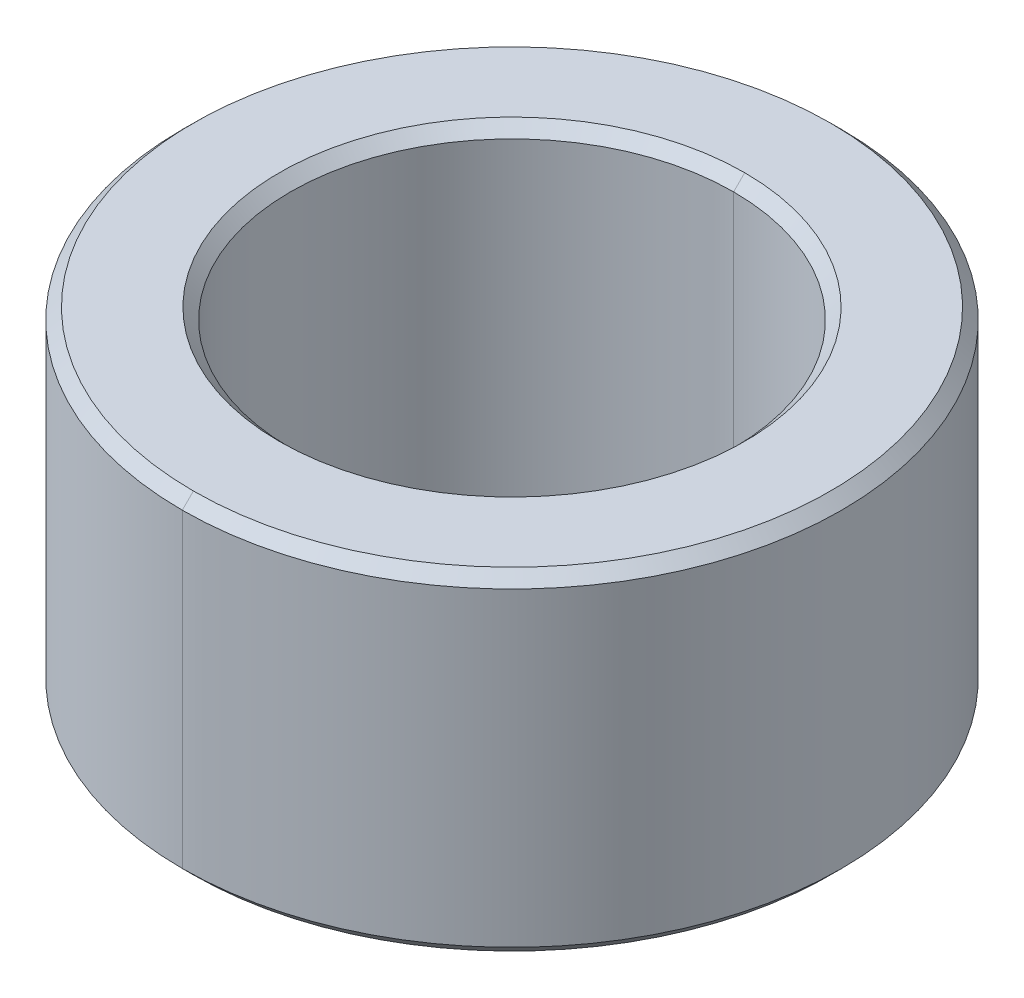
ISO-10303-21;
HEADER;
FILE_DESCRIPTION(('STEP AP214'),'2;1');
FILE_NAME('part.step','',(''),(''),'','','');
FILE_SCHEMA(('AUTOMOTIVE_DESIGN { 1 0 10303 214 1 1 1 1 }'));
ENDSEC;
DATA;
#1=APPLICATION_CONTEXT('core data for automotive mechanical design processes');
#2=APPLICATION_PROTOCOL_DEFINITION('international standard','automotive_design',2000,#1);
#3=PRODUCT_CONTEXT('',#1,'mechanical');
#4=PRODUCT('Part','Part','',(#3));
#5=PRODUCT_RELATED_PRODUCT_CATEGORY('part','',(#4));
#6=PRODUCT_DEFINITION_FORMATION('','',#4);
#7=PRODUCT_DEFINITION_CONTEXT('part definition',#1,'design');
#8=PRODUCT_DEFINITION('design','',#6,#7);
#9=PRODUCT_DEFINITION_SHAPE('','',#8);
#10=(LENGTH_UNIT() NAMED_UNIT(*) SI_UNIT(.MILLI.,.METRE.));
#11=(NAMED_UNIT(*) PLANE_ANGLE_UNIT() SI_UNIT($,.RADIAN.));
#12=(NAMED_UNIT(*) SI_UNIT($,.STERADIAN.) SOLID_ANGLE_UNIT());
#13=UNCERTAINTY_MEASURE_WITH_UNIT(LENGTH_MEASURE(1.E-05),#10,'distance_accuracy_value','');
#14=(GEOMETRIC_REPRESENTATION_CONTEXT(3) GLOBAL_UNCERTAINTY_ASSIGNED_CONTEXT((#13)) GLOBAL_UNIT_ASSIGNED_CONTEXT((#10,
#11,#12)) REPRESENTATION_CONTEXT('',''));
#15=CARTESIAN_POINT('',(0.,0.,0.));
#16=DIRECTION('',(0.,0.,1.));
#17=DIRECTION('',(1.,0.,0.));
#18=AXIS2_PLACEMENT_3D('',#15,#16,#17);
#19=CARTESIAN_POINT('',(0.,1.4,0.));
#20=DIRECTION('',(0.,1.,0.));
#21=DIRECTION('',(0.,0.,1.));
#22=AXIS2_PLACEMENT_3D('',#19,#20,#21);
#23=CONICAL_SURFACE('',#22,2.,0.78539816339745);
#24=DIRECTION('',(0.,0.707106781186546,-0.707106781186549));
#25=VECTOR('',#24,1.);
#26=CARTESIAN_POINT('',(0.,1.4,-2.));
#27=LINE('',#26,#25);
#28=CARTESIAN_POINT('',(0.,1.4,-2.));
#29=VERTEX_POINT('',#28);
#30=CARTESIAN_POINT('',(0.,1.5,-2.1));
#31=VERTEX_POINT('',#30);
#32=EDGE_CURVE('E126',#29,#31,#27,.T.);
#33=ORIENTED_EDGE('',*,*,#32,.F.);
#34=CARTESIAN_POINT('',(0.,1.4,0.));
#35=DIRECTION('',(0.,1.,0.));
#36=DIRECTION('',(0.,0.,1.));
#37=AXIS2_PLACEMENT_3D('',#34,#35,#36);
#38=CIRCLE('',#37,2.);
#39=CARTESIAN_POINT('',(0.,1.4,2.));
#40=VERTEX_POINT('',#39);
#41=EDGE_CURVE('E26',#40,#29,#38,.T.);
#42=ORIENTED_EDGE('',*,*,#41,.F.);
#43=DIRECTION('',(0.,0.707106781186546,0.707106781186549));
#44=VECTOR('',#43,1.);
#45=CARTESIAN_POINT('',(0.,1.4,2.));
#46=LINE('',#45,#44);
#47=CARTESIAN_POINT('',(0.,1.5,2.1));
#48=VERTEX_POINT('',#47);
#49=EDGE_CURVE('E118',#40,#48,#46,.T.);
#50=ORIENTED_EDGE('',*,*,#49,.T.);
#51=CARTESIAN_POINT('',(0.,1.5,0.));
#52=DIRECTION('',(0.,-1.,0.));
#53=DIRECTION('',(0.,0.,1.));
#54=AXIS2_PLACEMENT_3D('',#51,#52,#53);
#55=CIRCLE('',#54,2.1);
#56=EDGE_CURVE('E108',#31,#48,#55,.T.);
#57=ORIENTED_EDGE('',*,*,#56,.F.);
#58=EDGE_LOOP('',(#33,#42,#50,#57));
#59=FACE_BOUND('',#58,.T.);
#60=ADVANCED_FACE('F15',(#59),#23,.F.);
#61=CARTESIAN_POINT('',(0.,-1.5,0.));
#62=DIRECTION('',(0.,-1.,0.));
#63=DIRECTION('',(0.,0.,-1.));
#64=AXIS2_PLACEMENT_3D('',#61,#62,#63);
#65=CONICAL_SURFACE('',#64,2.1,0.78539816339744);
#66=DIRECTION('',(0.,-0.707106781186554,0.707106781186542));
#67=VECTOR('',#66,1.);
#68=CARTESIAN_POINT('',(0.,-1.5,2.1));
#69=LINE('',#68,#67);
#70=CARTESIAN_POINT('',(0.,-1.4,2.));
#71=VERTEX_POINT('',#70);
#72=CARTESIAN_POINT('',(0.,-1.5,2.1));
#73=VERTEX_POINT('',#72);
#74=EDGE_CURVE('E144',#71,#73,#69,.T.);
#75=ORIENTED_EDGE('',*,*,#74,.F.);
#76=CARTESIAN_POINT('',(0.,-1.4,0.));
#77=DIRECTION('',(0.,-1.,0.));
#78=DIRECTION('',(0.,0.,1.));
#79=AXIS2_PLACEMENT_3D('',#76,#77,#78);
#80=CIRCLE('',#79,2.);
#81=CARTESIAN_POINT('',(0.,-1.4,-2.));
#82=VERTEX_POINT('',#81);
#83=EDGE_CURVE('E10',#82,#71,#80,.T.);
#84=ORIENTED_EDGE('',*,*,#83,.F.);
#85=DIRECTION('',(0.,-0.707106781186554,-0.707106781186542));
#86=VECTOR('',#85,1.);
#87=CARTESIAN_POINT('',(0.,-1.5,-2.1));
#88=LINE('',#87,#86);
#89=CARTESIAN_POINT('',(0.,-1.5,-2.1));
#90=VERTEX_POINT('',#89);
#91=EDGE_CURVE('E143',#82,#90,#88,.T.);
#92=ORIENTED_EDGE('',*,*,#91,.T.);
#93=CARTESIAN_POINT('',(0.,-1.5,0.));
#94=DIRECTION('',(0.,1.,0.));
#95=DIRECTION('',(0.,0.,1.));
#96=AXIS2_PLACEMENT_3D('',#93,#94,#95);
#97=CIRCLE('',#96,2.1);
#98=EDGE_CURVE('E233',#73,#90,#97,.T.);
#99=ORIENTED_EDGE('',*,*,#98,.F.);
#100=EDGE_LOOP('',(#75,#84,#92,#99));
#101=FACE_BOUND('',#100,.T.);
#102=ADVANCED_FACE('F353',(#101),#65,.F.);
#103=CARTESIAN_POINT('',(0.,1.5,0.));
#104=DIRECTION('',(0.,-1.,0.));
#105=DIRECTION('',(0.,0.,-1.));
#106=AXIS2_PLACEMENT_3D('',#103,#104,#105);
#107=CONICAL_SURFACE('',#106,2.875,0.785398163397448);
#108=DIRECTION('',(0.,-0.707106781186548,0.707106781186548));
#109=VECTOR('',#108,1.);
#110=CARTESIAN_POINT('',(0.,1.5,2.875));
#111=LINE('',#110,#109);
#112=CARTESIAN_POINT('',(0.,1.5,2.875));
#113=VERTEX_POINT('',#112);
#114=CARTESIAN_POINT('',(0.,1.4,2.975));
#115=VERTEX_POINT('',#114);
#116=EDGE_CURVE('E19',#113,#115,#111,.T.);
#117=ORIENTED_EDGE('',*,*,#116,.F.);
#118=CARTESIAN_POINT('',(0.,1.5,0.));
#119=DIRECTION('',(0.,1.,0.));
#120=DIRECTION('',(0.,0.,1.));
#121=AXIS2_PLACEMENT_3D('',#118,#119,#120);
#122=CIRCLE('',#121,2.875);
#123=CARTESIAN_POINT('',(0.,1.5,-2.875));
#124=VERTEX_POINT('',#123);
#125=EDGE_CURVE('E115',#124,#113,#122,.T.);
#126=ORIENTED_EDGE('',*,*,#125,.F.);
#127=DIRECTION('',(0.,-0.707106781186548,-0.707106781186548));
#128=VECTOR('',#127,1.);
#129=CARTESIAN_POINT('',(0.,1.5,-2.875));
#130=LINE('',#129,#128);
#131=CARTESIAN_POINT('',(0.,1.4,-2.975));
#132=VERTEX_POINT('',#131);
#133=EDGE_CURVE('E146',#124,#132,#130,.T.);
#134=ORIENTED_EDGE('',*,*,#133,.T.);
#135=CARTESIAN_POINT('',(0.,1.4,0.));
#136=DIRECTION('',(0.,-1.,0.));
#137=DIRECTION('',(0.,0.,1.));
#138=AXIS2_PLACEMENT_3D('',#135,#136,#137);
#139=CIRCLE('',#138,2.975);
#140=EDGE_CURVE('E204',#115,#132,#139,.T.);
#141=ORIENTED_EDGE('',*,*,#140,.F.);
#142=EDGE_LOOP('',(#117,#126,#134,#141));
#143=FACE_BOUND('',#142,.T.);
#144=ADVANCED_FACE('F202',(#143),#107,.T.);
#145=CARTESIAN_POINT('',(0.,-1.4,0.));
#146=DIRECTION('',(0.,1.,0.));
#147=DIRECTION('',(0.,0.,1.));
#148=AXIS2_PLACEMENT_3D('',#145,#146,#147);
#149=CONICAL_SURFACE('',#148,2.975,0.785398163397448);
#150=DIRECTION('',(0.,0.707106781186548,-0.707106781186548));
#151=VECTOR('',#150,1.);
#152=CARTESIAN_POINT('',(0.,-1.4,-2.975));
#153=LINE('',#152,#151);
#154=CARTESIAN_POINT('',(0.,-1.5,-2.875));
#155=VERTEX_POINT('',#154);
#156=CARTESIAN_POINT('',(0.,-1.4,-2.975));
#157=VERTEX_POINT('',#156);
#158=EDGE_CURVE('E187',#155,#157,#153,.T.);
#159=ORIENTED_EDGE('',*,*,#158,.F.);
#160=CARTESIAN_POINT('',(0.,-1.5,0.));
#161=DIRECTION('',(0.,-1.,0.));
#162=DIRECTION('',(0.,0.,1.));
#163=AXIS2_PLACEMENT_3D('',#160,#161,#162);
#164=CIRCLE('',#163,2.875);
#165=CARTESIAN_POINT('',(0.,-1.5,2.875));
#166=VERTEX_POINT('',#165);
#167=EDGE_CURVE('E114',#166,#155,#164,.T.);
#168=ORIENTED_EDGE('',*,*,#167,.F.);
#169=DIRECTION('',(0.,0.707106781186548,0.707106781186548));
#170=VECTOR('',#169,1.);
#171=CARTESIAN_POINT('',(0.,-1.4,2.975));
#172=LINE('',#171,#170);
#173=CARTESIAN_POINT('',(0.,-1.4,2.975));
#174=VERTEX_POINT('',#173);
#175=EDGE_CURVE('E167',#166,#174,#172,.T.);
#176=ORIENTED_EDGE('',*,*,#175,.T.);
#177=CARTESIAN_POINT('',(0.,-1.4,0.));
#178=DIRECTION('',(0.,1.,0.));
#179=DIRECTION('',(0.,0.,1.));
#180=AXIS2_PLACEMENT_3D('',#177,#178,#179);
#181=CIRCLE('',#180,2.975);
#182=EDGE_CURVE('E41',#157,#174,#181,.T.);
#183=ORIENTED_EDGE('',*,*,#182,.F.);
#184=EDGE_LOOP('',(#159,#168,#176,#183));
#185=FACE_BOUND('',#184,.T.);
#186=ADVANCED_FACE('F242',(#185),#149,.T.);
#187=CARTESIAN_POINT('',(0.,1.5,0.));
#188=DIRECTION('',(0.,-1.,0.));
#189=DIRECTION('',(0.,0.,-1.));
#190=AXIS2_PLACEMENT_3D('',#187,#188,#189);
#191=CYLINDRICAL_SURFACE('',#190,2.);
#192=DIRECTION('',(0.,-1.,0.));
#193=VECTOR('',#192,1.);
#194=CARTESIAN_POINT('',(0.,1.5,2.));
#195=LINE('',#194,#193);
#196=EDGE_CURVE('E164',#40,#71,#195,.T.);
#197=ORIENTED_EDGE('',*,*,#196,.F.);
#198=ORIENTED_EDGE('',*,*,#41,.T.);
#199=DIRECTION('',(0.,-1.,0.));
#200=VECTOR('',#199,1.);
#201=CARTESIAN_POINT('',(0.,1.5,-2.));
#202=LINE('',#201,#200);
#203=EDGE_CURVE('E166',#29,#82,#202,.T.);
#204=ORIENTED_EDGE('',*,*,#203,.T.);
#205=ORIENTED_EDGE('',*,*,#83,.T.);
#206=EDGE_LOOP('',(#197,#198,#204,#205));
#207=FACE_BOUND('',#206,.T.);
#208=ADVANCED_FACE('F348',(#207),#191,.F.);
#209=CARTESIAN_POINT('',(0.,1.5,0.));
#210=DIRECTION('',(0.,-1.,0.));
#211=DIRECTION('',(0.,0.,-1.));
#212=AXIS2_PLACEMENT_3D('',#209,#210,#211);
#213=CYLINDRICAL_SURFACE('',#212,2.975);
#214=DIRECTION('',(0.,-1.,0.));
#215=VECTOR('',#214,1.);
#216=CARTESIAN_POINT('',(0.,1.5,2.975));
#217=LINE('',#216,#215);
#218=EDGE_CURVE('E157',#115,#174,#217,.T.);
#219=ORIENTED_EDGE('',*,*,#218,.F.);
#220=ORIENTED_EDGE('',*,*,#140,.T.);
#221=DIRECTION('',(0.,-1.,0.));
#222=VECTOR('',#221,1.);
#223=CARTESIAN_POINT('',(0.,1.5,-2.975));
#224=LINE('',#223,#222);
#225=EDGE_CURVE('E154',#132,#157,#224,.T.);
#226=ORIENTED_EDGE('',*,*,#225,.T.);
#227=ORIENTED_EDGE('',*,*,#182,.T.);
#228=EDGE_LOOP('',(#219,#220,#226,#227));
#229=FACE_BOUND('',#228,.T.);
#230=ADVANCED_FACE('F372',(#229),#213,.T.);
#231=CARTESIAN_POINT('',(0.,-1.5,0.));
#232=DIRECTION('',(0.,1.,0.));
#233=DIRECTION('',(1.,0.,0.));
#234=AXIS2_PLACEMENT_3D('',#231,#232,#233);
#235=PLANE('',#234);
#236=CARTESIAN_POINT('',(0.,-1.5,0.));
#237=DIRECTION('',(0.,1.,0.));
#238=DIRECTION('',(0.,0.,1.));
#239=AXIS2_PLACEMENT_3D('',#236,#237,#238);
#240=CIRCLE('',#239,2.1);
#241=EDGE_CURVE('E140',#90,#73,#240,.T.);
#242=ORIENTED_EDGE('',*,*,#241,.T.);
#243=ORIENTED_EDGE('',*,*,#98,.T.);
#244=EDGE_LOOP('',(#242,#243));
#245=FACE_BOUND('',#244,.T.);
#246=ORIENTED_EDGE('',*,*,#167,.T.);
#247=CARTESIAN_POINT('',(0.,-1.5,0.));
#248=DIRECTION('',(0.,-1.,0.));
#249=DIRECTION('',(0.,0.,1.));
#250=AXIS2_PLACEMENT_3D('',#247,#248,#249);
#251=CIRCLE('',#250,2.875);
#252=EDGE_CURVE('E150',#155,#166,#251,.T.);
#253=ORIENTED_EDGE('',*,*,#252,.T.);
#254=EDGE_LOOP('',(#246,#253));
#255=FACE_BOUND('',#254,.T.);
#256=ADVANCED_FACE('F239',(#245,#255),#235,.F.);
#257=CARTESIAN_POINT('',(0.,1.5,0.));
#258=DIRECTION('',(0.,1.,0.));
#259=DIRECTION('',(1.,0.,0.));
#260=AXIS2_PLACEMENT_3D('',#257,#258,#259);
#261=PLANE('',#260);
#262=CARTESIAN_POINT('',(0.,1.5,0.));
#263=DIRECTION('',(0.,-1.,0.));
#264=DIRECTION('',(0.,0.,1.));
#265=AXIS2_PLACEMENT_3D('',#262,#263,#264);
#266=CIRCLE('',#265,2.1);
#267=EDGE_CURVE('E111',#48,#31,#266,.T.);
#268=ORIENTED_EDGE('',*,*,#267,.T.);
#269=ORIENTED_EDGE('',*,*,#56,.T.);
#270=EDGE_LOOP('',(#268,#269));
#271=FACE_BOUND('',#270,.T.);
#272=ORIENTED_EDGE('',*,*,#125,.T.);
#273=CARTESIAN_POINT('',(0.,1.5,0.));
#274=DIRECTION('',(0.,1.,0.));
#275=DIRECTION('',(0.,0.,1.));
#276=AXIS2_PLACEMENT_3D('',#273,#274,#275);
#277=CIRCLE('',#276,2.875);
#278=EDGE_CURVE('E163',#113,#124,#277,.T.);
#279=ORIENTED_EDGE('',*,*,#278,.T.);
#280=EDGE_LOOP('',(#272,#279));
#281=FACE_BOUND('',#280,.T.);
#282=ADVANCED_FACE('F17',(#271,#281),#261,.T.);
#283=CARTESIAN_POINT('',(0.,1.5,0.));
#284=DIRECTION('',(0.,-1.,0.));
#285=DIRECTION('',(0.,0.,-1.));
#286=AXIS2_PLACEMENT_3D('',#283,#284,#285);
#287=CYLINDRICAL_SURFACE('',#286,2.975);
#288=CARTESIAN_POINT('',(0.,1.4,0.));
#289=DIRECTION('',(0.,-1.,0.));
#290=DIRECTION('',(0.,0.,1.));
#291=AXIS2_PLACEMENT_3D('',#288,#289,#290);
#292=CIRCLE('',#291,2.975);
#293=EDGE_CURVE('E138',#132,#115,#292,.T.);
#294=ORIENTED_EDGE('',*,*,#293,.T.);
#295=ORIENTED_EDGE('',*,*,#218,.T.);
#296=CARTESIAN_POINT('',(0.,-1.4,0.));
#297=DIRECTION('',(0.,1.,0.));
#298=DIRECTION('',(0.,0.,1.));
#299=AXIS2_PLACEMENT_3D('',#296,#297,#298);
#300=CIRCLE('',#299,2.975);
#301=EDGE_CURVE('E177',#174,#157,#300,.T.);
#302=ORIENTED_EDGE('',*,*,#301,.T.);
#303=ORIENTED_EDGE('',*,*,#225,.F.);
#304=EDGE_LOOP('',(#294,#295,#302,#303));
#305=FACE_BOUND('',#304,.T.);
#306=ADVANCED_FACE('F247',(#305),#287,.T.);
#307=CARTESIAN_POINT('',(0.,1.5,0.));
#308=DIRECTION('',(0.,-1.,0.));
#309=DIRECTION('',(0.,0.,-1.));
#310=AXIS2_PLACEMENT_3D('',#307,#308,#309);
#311=CYLINDRICAL_SURFACE('',#310,2.);
#312=CARTESIAN_POINT('',(0.,1.4,0.));
#313=DIRECTION('',(0.,1.,0.));
#314=DIRECTION('',(0.,0.,1.));
#315=AXIS2_PLACEMENT_3D('',#312,#313,#314);
#316=CIRCLE('',#315,2.);
#317=EDGE_CURVE('E134',#29,#40,#316,.T.);
#318=ORIENTED_EDGE('',*,*,#317,.T.);
#319=ORIENTED_EDGE('',*,*,#196,.T.);
#320=CARTESIAN_POINT('',(0.,-1.4,0.));
#321=DIRECTION('',(0.,-1.,0.));
#322=DIRECTION('',(0.,0.,1.));
#323=AXIS2_PLACEMENT_3D('',#320,#321,#322);
#324=CIRCLE('',#323,2.);
#325=EDGE_CURVE('E123',#71,#82,#324,.T.);
#326=ORIENTED_EDGE('',*,*,#325,.T.);
#327=ORIENTED_EDGE('',*,*,#203,.F.);
#328=EDGE_LOOP('',(#318,#319,#326,#327));
#329=FACE_BOUND('',#328,.T.);
#330=ADVANCED_FACE('F326',(#329),#311,.F.);
#331=CARTESIAN_POINT('',(0.,-1.4,0.));
#332=DIRECTION('',(0.,1.,0.));
#333=DIRECTION('',(0.,0.,1.));
#334=AXIS2_PLACEMENT_3D('',#331,#332,#333);
#335=CONICAL_SURFACE('',#334,2.975,0.785398163397448);
#336=ORIENTED_EDGE('',*,*,#252,.F.);
#337=ORIENTED_EDGE('',*,*,#158,.T.);
#338=ORIENTED_EDGE('',*,*,#301,.F.);
#339=ORIENTED_EDGE('',*,*,#175,.F.);
#340=EDGE_LOOP('',(#336,#337,#338,#339));
#341=FACE_BOUND('',#340,.T.);
#342=ADVANCED_FACE('F243',(#341),#335,.T.);
#343=CARTESIAN_POINT('',(0.,1.5,0.));
#344=DIRECTION('',(0.,-1.,0.));
#345=DIRECTION('',(0.,0.,-1.));
#346=AXIS2_PLACEMENT_3D('',#343,#344,#345);
#347=CONICAL_SURFACE('',#346,2.875,0.785398163397448);
#348=ORIENTED_EDGE('',*,*,#278,.F.);
#349=ORIENTED_EDGE('',*,*,#116,.T.);
#350=ORIENTED_EDGE('',*,*,#293,.F.);
#351=ORIENTED_EDGE('',*,*,#133,.F.);
#352=EDGE_LOOP('',(#348,#349,#350,#351));
#353=FACE_BOUND('',#352,.T.);
#354=ADVANCED_FACE('F207',(#353),#347,.T.);
#355=CARTESIAN_POINT('',(0.,-1.5,0.));
#356=DIRECTION('',(0.,-1.,0.));
#357=DIRECTION('',(0.,0.,-1.));
#358=AXIS2_PLACEMENT_3D('',#355,#356,#357);
#359=CONICAL_SURFACE('',#358,2.1,0.78539816339744);
#360=ORIENTED_EDGE('',*,*,#325,.F.);
#361=ORIENTED_EDGE('',*,*,#74,.T.);
#362=ORIENTED_EDGE('',*,*,#241,.F.);
#363=ORIENTED_EDGE('',*,*,#91,.F.);
#364=EDGE_LOOP('',(#360,#361,#362,#363));
#365=FACE_BOUND('',#364,.T.);
#366=ADVANCED_FACE('F318',(#365),#359,.F.);
#367=CARTESIAN_POINT('',(0.,1.4,0.));
#368=DIRECTION('',(0.,1.,0.));
#369=DIRECTION('',(0.,0.,1.));
#370=AXIS2_PLACEMENT_3D('',#367,#368,#369);
#371=CONICAL_SURFACE('',#370,2.,0.78539816339745);
#372=ORIENTED_EDGE('',*,*,#317,.F.);
#373=ORIENTED_EDGE('',*,*,#32,.T.);
#374=ORIENTED_EDGE('',*,*,#267,.F.);
#375=ORIENTED_EDGE('',*,*,#49,.F.);
#376=EDGE_LOOP('',(#372,#373,#374,#375));
#377=FACE_BOUND('',#376,.T.);
#378=ADVANCED_FACE('F125',(#377),#371,.F.);
#379=CLOSED_SHELL('',(#60,#102,#144,#186,#208,#230,#256,#282,#306,#330,#342,#354,#366,#378));
#380=MANIFOLD_SOLID_BREP('B1',#379);
#381=ADVANCED_BREP_SHAPE_REPRESENTATION('',(#18,#380),#14);
#382=SHAPE_DEFINITION_REPRESENTATION(#9,#381);
ENDSEC;
END-ISO-10303-21;
